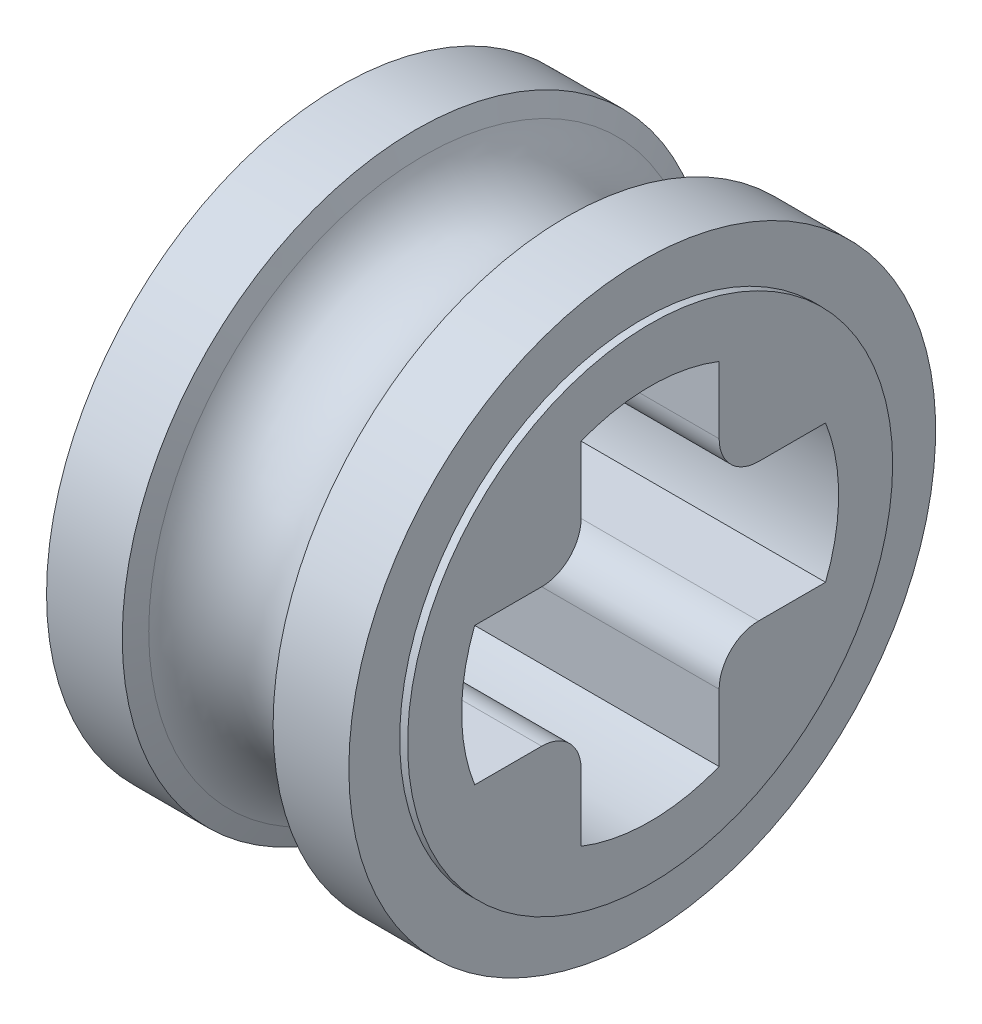
ISO-10303-21;
HEADER;
FILE_DESCRIPTION(('STEP AP214'),'2;1');
FILE_NAME('part.step','',(''),(''),'','','');
FILE_SCHEMA(('AUTOMOTIVE_DESIGN { 1 0 10303 214 1 1 1 1 }'));
ENDSEC;
DATA;
#1=APPLICATION_CONTEXT('core data for automotive mechanical design processes');
#2=APPLICATION_PROTOCOL_DEFINITION('international standard','automotive_design',2000,#1);
#3=PRODUCT_CONTEXT('',#1,'mechanical');
#4=PRODUCT('Part','Part','',(#3));
#5=PRODUCT_RELATED_PRODUCT_CATEGORY('part','',(#4));
#6=PRODUCT_DEFINITION_FORMATION('','',#4);
#7=PRODUCT_DEFINITION_CONTEXT('part definition',#1,'design');
#8=PRODUCT_DEFINITION('design','',#6,#7);
#9=PRODUCT_DEFINITION_SHAPE('','',#8);
#10=(LENGTH_UNIT() NAMED_UNIT(*) SI_UNIT(.MILLI.,.METRE.));
#11=(NAMED_UNIT(*) PLANE_ANGLE_UNIT() SI_UNIT($,.RADIAN.));
#12=(NAMED_UNIT(*) SI_UNIT($,.STERADIAN.) SOLID_ANGLE_UNIT());
#13=UNCERTAINTY_MEASURE_WITH_UNIT(LENGTH_MEASURE(1.E-05),#10,'distance_accuracy_value','');
#14=(GEOMETRIC_REPRESENTATION_CONTEXT(3) GLOBAL_UNCERTAINTY_ASSIGNED_CONTEXT((#13)) GLOBAL_UNIT_ASSIGNED_CONTEXT((#10,
#11,#12)) REPRESENTATION_CONTEXT('',''));
#15=CARTESIAN_POINT('',(0.,0.,0.));
#16=DIRECTION('',(0.,0.,1.));
#17=DIRECTION('',(1.,0.,0.));
#18=AXIS2_PLACEMENT_3D('',#15,#16,#17);
#19=CARTESIAN_POINT('',(2.03131848710658,1.37499999999999,1.37499999999999));
#20=DIRECTION('',(-1.,0.,0.));
#21=DIRECTION('',(0.,0.,1.));
#22=AXIS2_PLACEMENT_3D('',#19,#20,#21);
#23=CYLINDRICAL_SURFACE('',#22,0.5);
#24=DIRECTION('',(1.,0.,0.));
#25=VECTOR('',#24,1.);
#26=CARTESIAN_POINT('',(4.0325,0.874999999999994,1.37499999999999));
#27=LINE('',#26,#25);
#28=CARTESIAN_POINT('',(2.01625,0.874999999999994,1.37499999999999));
#29=VERTEX_POINT('',#28);
#30=CARTESIAN_POINT('',(-2.01625,0.874999999999994,1.37499999999999));
#31=VERTEX_POINT('',#30);
#32=EDGE_CURVE('E157',#29,#31,#27,.F.);
#33=ORIENTED_EDGE('',*,*,#32,.T.);
#34=CARTESIAN_POINT('',(-2.01625,1.37499999999999,1.37499999999999));
#35=DIRECTION('',(-1.,0.,0.));
#36=DIRECTION('',(0.,0.,1.));
#37=AXIS2_PLACEMENT_3D('',#34,#35,#36);
#38=CIRCLE('',#37,0.5);
#39=CARTESIAN_POINT('',(-2.01625,1.37499999999999,0.874999999999995));
#40=VERTEX_POINT('',#39);
#41=EDGE_CURVE('E139',#31,#40,#38,.F.);
#42=ORIENTED_EDGE('',*,*,#41,.T.);
#43=DIRECTION('',(1.,0.,0.));
#44=VECTOR('',#43,1.);
#45=CARTESIAN_POINT('',(4.0325,1.37499999999999,0.874999999999995));
#46=LINE('',#45,#44);
#47=CARTESIAN_POINT('',(2.01625,1.37499999999999,0.874999999999995));
#48=VERTEX_POINT('',#47);
#49=EDGE_CURVE('E143',#40,#48,#46,.T.);
#50=ORIENTED_EDGE('',*,*,#49,.T.);
#51=CARTESIAN_POINT('',(2.01625,1.37499999999999,1.37499999999999));
#52=DIRECTION('',(-1.,0.,0.));
#53=DIRECTION('',(0.,0.,1.));
#54=AXIS2_PLACEMENT_3D('',#51,#52,#53);
#55=CIRCLE('',#54,0.5);
#56=EDGE_CURVE('E19',#48,#29,#55,.T.);
#57=ORIENTED_EDGE('',*,*,#56,.T.);
#58=EDGE_LOOP('',(#33,#42,#50,#57));
#59=FACE_BOUND('',#58,.T.);
#60=ADVANCED_FACE('F16',(#59),#23,.T.);
#61=CARTESIAN_POINT('',(2.03131848710658,1.37499999999999,-1.37499999999999));
#62=DIRECTION('',(-1.,0.,0.));
#63=DIRECTION('',(0.,0.,1.));
#64=AXIS2_PLACEMENT_3D('',#61,#62,#63);
#65=CYLINDRICAL_SURFACE('',#64,0.5);
#66=DIRECTION('',(1.,0.,0.));
#67=VECTOR('',#66,1.);
#68=CARTESIAN_POINT('',(4.0325,1.37499999999999,-0.874999999999995));
#69=LINE('',#68,#67);
#70=CARTESIAN_POINT('',(2.01625,1.37499999999999,-0.874999999999995));
#71=VERTEX_POINT('',#70);
#72=CARTESIAN_POINT('',(-2.01625,1.37499999999999,-0.874999999999995));
#73=VERTEX_POINT('',#72);
#74=EDGE_CURVE('E155',#71,#73,#69,.F.);
#75=ORIENTED_EDGE('',*,*,#74,.T.);
#76=CARTESIAN_POINT('',(-2.01625,1.37499999999999,-1.37499999999999));
#77=DIRECTION('',(-1.,0.,0.));
#78=DIRECTION('',(0.,0.,1.));
#79=AXIS2_PLACEMENT_3D('',#76,#77,#78);
#80=CIRCLE('',#79,0.5);
#81=CARTESIAN_POINT('',(-2.01625,0.874999999999994,-1.37499999999999));
#82=VERTEX_POINT('',#81);
#83=EDGE_CURVE('E214',#73,#82,#80,.F.);
#84=ORIENTED_EDGE('',*,*,#83,.T.);
#85=DIRECTION('',(1.,0.,0.));
#86=VECTOR('',#85,1.);
#87=CARTESIAN_POINT('',(4.0325,0.874999999999994,-1.37499999999999));
#88=LINE('',#87,#86);
#89=CARTESIAN_POINT('',(2.01625,0.874999999999994,-1.37499999999999));
#90=VERTEX_POINT('',#89);
#91=EDGE_CURVE('E223',#82,#90,#88,.T.);
#92=ORIENTED_EDGE('',*,*,#91,.T.);
#93=CARTESIAN_POINT('',(2.01625,1.37499999999999,-1.37499999999999));
#94=DIRECTION('',(-1.,0.,0.));
#95=DIRECTION('',(0.,0.,1.));
#96=AXIS2_PLACEMENT_3D('',#93,#94,#95);
#97=CIRCLE('',#96,0.5);
#98=EDGE_CURVE('E216',#90,#71,#97,.T.);
#99=ORIENTED_EDGE('',*,*,#98,.T.);
#100=EDGE_LOOP('',(#75,#84,#92,#99));
#101=FACE_BOUND('',#100,.T.);
#102=ADVANCED_FACE('F221',(#101),#65,.T.);
#103=CARTESIAN_POINT('',(2.03131848710658,-1.37499999999999,-1.37499999999999));
#104=DIRECTION('',(-1.,0.,0.));
#105=DIRECTION('',(0.,0.,1.));
#106=AXIS2_PLACEMENT_3D('',#103,#104,#105);
#107=CYLINDRICAL_SURFACE('',#106,0.5);
#108=DIRECTION('',(1.,0.,0.));
#109=VECTOR('',#108,1.);
#110=CARTESIAN_POINT('',(4.0325,-0.874999999999994,-1.37499999999999));
#111=LINE('',#110,#109);
#112=CARTESIAN_POINT('',(2.01625,-0.874999999999994,-1.37499999999999));
#113=VERTEX_POINT('',#112);
#114=CARTESIAN_POINT('',(-2.01625,-0.874999999999994,-1.37499999999999));
#115=VERTEX_POINT('',#114);
#116=EDGE_CURVE('E253',#113,#115,#111,.F.);
#117=ORIENTED_EDGE('',*,*,#116,.T.);
#118=CARTESIAN_POINT('',(-2.01625,-1.37499999999999,-1.37499999999999));
#119=DIRECTION('',(-1.,0.,0.));
#120=DIRECTION('',(0.,0.,1.));
#121=AXIS2_PLACEMENT_3D('',#118,#119,#120);
#122=CIRCLE('',#121,0.5);
#123=CARTESIAN_POINT('',(-2.01625,-1.37499999999999,-0.874999999999995));
#124=VERTEX_POINT('',#123);
#125=EDGE_CURVE('E210',#115,#124,#122,.F.);
#126=ORIENTED_EDGE('',*,*,#125,.T.);
#127=DIRECTION('',(1.,0.,0.));
#128=VECTOR('',#127,1.);
#129=CARTESIAN_POINT('',(4.0325,-1.37499999999999,-0.874999999999995));
#130=LINE('',#129,#128);
#131=CARTESIAN_POINT('',(2.01625,-1.37499999999999,-0.874999999999995));
#132=VERTEX_POINT('',#131);
#133=EDGE_CURVE('E248',#124,#132,#130,.T.);
#134=ORIENTED_EDGE('',*,*,#133,.T.);
#135=CARTESIAN_POINT('',(2.01625,-1.37499999999999,-1.37499999999999));
#136=DIRECTION('',(-1.,0.,0.));
#137=DIRECTION('',(0.,0.,1.));
#138=AXIS2_PLACEMENT_3D('',#135,#136,#137);
#139=CIRCLE('',#138,0.5);
#140=EDGE_CURVE('E212',#132,#113,#139,.T.);
#141=ORIENTED_EDGE('',*,*,#140,.T.);
#142=EDGE_LOOP('',(#117,#126,#134,#141));
#143=FACE_BOUND('',#142,.T.);
#144=ADVANCED_FACE('F387',(#143),#107,.T.);
#145=CARTESIAN_POINT('',(2.03131848710658,-1.37499999999999,1.37499999999999));
#146=DIRECTION('',(-1.,0.,0.));
#147=DIRECTION('',(0.,0.,1.));
#148=AXIS2_PLACEMENT_3D('',#145,#146,#147);
#149=CYLINDRICAL_SURFACE('',#148,0.5);
#150=DIRECTION('',(1.,0.,0.));
#151=VECTOR('',#150,1.);
#152=CARTESIAN_POINT('',(4.0325,-1.37499999999999,0.874999999999995));
#153=LINE('',#152,#151);
#154=CARTESIAN_POINT('',(2.01625,-1.37499999999999,0.874999999999995));
#155=VERTEX_POINT('',#154);
#156=CARTESIAN_POINT('',(-2.01625,-1.37499999999999,0.874999999999995));
#157=VERTEX_POINT('',#156);
#158=EDGE_CURVE('E244',#155,#157,#153,.F.);
#159=ORIENTED_EDGE('',*,*,#158,.T.);
#160=CARTESIAN_POINT('',(-2.01625,-1.37499999999999,1.37499999999999));
#161=DIRECTION('',(-1.,0.,0.));
#162=DIRECTION('',(0.,0.,1.));
#163=AXIS2_PLACEMENT_3D('',#160,#161,#162);
#164=CIRCLE('',#163,0.5);
#165=CARTESIAN_POINT('',(-2.01625,-0.874999999999994,1.37499999999999));
#166=VERTEX_POINT('',#165);
#167=EDGE_CURVE('E164',#157,#166,#164,.F.);
#168=ORIENTED_EDGE('',*,*,#167,.T.);
#169=DIRECTION('',(1.,0.,0.));
#170=VECTOR('',#169,1.);
#171=CARTESIAN_POINT('',(4.0325,-0.874999999999994,1.37499999999999));
#172=LINE('',#171,#170);
#173=CARTESIAN_POINT('',(2.01625,-0.874999999999994,1.37499999999999));
#174=VERTEX_POINT('',#173);
#175=EDGE_CURVE('E160',#166,#174,#172,.T.);
#176=ORIENTED_EDGE('',*,*,#175,.T.);
#177=CARTESIAN_POINT('',(2.01625,-1.37499999999999,1.37499999999999));
#178=DIRECTION('',(-1.,0.,0.));
#179=DIRECTION('',(0.,0.,1.));
#180=AXIS2_PLACEMENT_3D('',#177,#178,#179);
#181=CIRCLE('',#180,0.5);
#182=EDGE_CURVE('E208',#174,#155,#181,.T.);
#183=ORIENTED_EDGE('',*,*,#182,.T.);
#184=EDGE_LOOP('',(#159,#168,#176,#183));
#185=FACE_BOUND('',#184,.T.);
#186=ADVANCED_FACE('F383',(#185),#149,.T.);
#187=CARTESIAN_POINT('',(4.0325,-0.874999999999994,0.874999999999995));
#188=DIRECTION('',(0.,-1.,0.));
#189=DIRECTION('',(0.,0.,-1.));
#190=AXIS2_PLACEMENT_3D('',#187,#188,#189);
#191=PLANE('',#190);
#192=DIRECTION('',(-1.,0.,0.));
#193=VECTOR('',#192,1.);
#194=CARTESIAN_POINT('',(4.0325,-0.874999999999995,2.22406722020716));
#195=LINE('',#194,#193);
#196=CARTESIAN_POINT('',(-2.01625,-0.874999999999995,2.22406722020716));
#197=VERTEX_POINT('',#196);
#198=CARTESIAN_POINT('',(2.01625,-0.874999999999995,2.22406722020716));
#199=VERTEX_POINT('',#198);
#200=EDGE_CURVE('E271',#197,#199,#195,.F.);
#201=ORIENTED_EDGE('',*,*,#200,.T.);
#202=DIRECTION('',(0.,0.,-1.));
#203=VECTOR('',#202,1.);
#204=CARTESIAN_POINT('',(2.01625,-0.874999999999994,0.874999999999995));
#205=LINE('',#204,#203);
#206=EDGE_CURVE('E163',#174,#199,#205,.F.);
#207=ORIENTED_EDGE('',*,*,#206,.F.);
#208=ORIENTED_EDGE('',*,*,#175,.F.);
#209=DIRECTION('',(0.,0.,-1.));
#210=VECTOR('',#209,1.);
#211=CARTESIAN_POINT('',(-2.01625,-0.874999999999994,0.874999999999995));
#212=LINE('',#211,#210);
#213=EDGE_CURVE('E159',#197,#166,#212,.T.);
#214=ORIENTED_EDGE('',*,*,#213,.F.);
#215=EDGE_LOOP('',(#201,#207,#208,#214));
#216=FACE_BOUND('',#215,.T.);
#217=ADVANCED_FACE('F379',(#216),#191,.F.);
#218=CARTESIAN_POINT('',(4.0325,0.874999999999995,2.22406722020716));
#219=DIRECTION('',(0.,1.,0.));
#220=DIRECTION('',(0.,0.,1.));
#221=AXIS2_PLACEMENT_3D('',#218,#219,#220);
#222=PLANE('',#221);
#223=DIRECTION('',(-1.,0.,0.));
#224=VECTOR('',#223,1.);
#225=CARTESIAN_POINT('',(4.0325,0.874999999999995,2.22406722020716));
#226=LINE('',#225,#224);
#227=CARTESIAN_POINT('',(2.01625,0.874999999999995,2.22406722020716));
#228=VERTEX_POINT('',#227);
#229=CARTESIAN_POINT('',(-2.01625,0.874999999999995,2.22406722020716));
#230=VERTEX_POINT('',#229);
#231=EDGE_CURVE('E274',#228,#230,#226,.T.);
#232=ORIENTED_EDGE('',*,*,#231,.T.);
#233=DIRECTION('',(0.,0.,1.));
#234=VECTOR('',#233,1.);
#235=CARTESIAN_POINT('',(-2.01625,0.874999999999995,2.22406722020716));
#236=LINE('',#235,#234);
#237=EDGE_CURVE('E151',#31,#230,#236,.T.);
#238=ORIENTED_EDGE('',*,*,#237,.F.);
#239=ORIENTED_EDGE('',*,*,#32,.F.);
#240=DIRECTION('',(0.,0.,1.));
#241=VECTOR('',#240,1.);
#242=CARTESIAN_POINT('',(2.01625,0.874999999999995,2.22406722020716));
#243=LINE('',#242,#241);
#244=EDGE_CURVE('E134',#228,#29,#243,.F.);
#245=ORIENTED_EDGE('',*,*,#244,.F.);
#246=EDGE_LOOP('',(#232,#238,#239,#245));
#247=FACE_BOUND('',#246,.T.);
#248=ADVANCED_FACE('F376',(#247),#222,.F.);
#249=CARTESIAN_POINT('',(4.0325,0.874999999999994,0.874999999999995));
#250=DIRECTION('',(0.,0.,1.));
#251=DIRECTION('',(1.,0.,0.));
#252=AXIS2_PLACEMENT_3D('',#249,#250,#251);
#253=PLANE('',#252);
#254=DIRECTION('',(-1.,0.,0.));
#255=VECTOR('',#254,1.);
#256=CARTESIAN_POINT('',(4.0325,2.22406722020716,0.874999999999995));
#257=LINE('',#256,#255);
#258=CARTESIAN_POINT('',(-2.01625,2.22406722020716,0.874999999999995));
#259=VERTEX_POINT('',#258);
#260=CARTESIAN_POINT('',(2.01625,2.22406722020716,0.874999999999995));
#261=VERTEX_POINT('',#260);
#262=EDGE_CURVE('E146',#259,#261,#257,.F.);
#263=ORIENTED_EDGE('',*,*,#262,.T.);
#264=DIRECTION('',(0.,1.,0.));
#265=VECTOR('',#264,1.);
#266=CARTESIAN_POINT('',(2.01625,0.874999999999994,0.874999999999995));
#267=LINE('',#266,#265);
#268=EDGE_CURVE('E131',#48,#261,#267,.T.);
#269=ORIENTED_EDGE('',*,*,#268,.F.);
#270=ORIENTED_EDGE('',*,*,#49,.F.);
#271=DIRECTION('',(0.,1.,0.));
#272=VECTOR('',#271,1.);
#273=CARTESIAN_POINT('',(-2.01625,0.874999999999994,0.874999999999995));
#274=LINE('',#273,#272);
#275=EDGE_CURVE('E148',#259,#40,#274,.F.);
#276=ORIENTED_EDGE('',*,*,#275,.F.);
#277=EDGE_LOOP('',(#263,#269,#270,#276));
#278=FACE_BOUND('',#277,.T.);
#279=ADVANCED_FACE('F142',(#278),#253,.F.);
#280=CARTESIAN_POINT('',(4.0325,2.22406722020716,-0.874999999999995));
#281=DIRECTION('',(0.,0.,-1.));
#282=DIRECTION('',(0.,1.,0.));
#283=AXIS2_PLACEMENT_3D('',#280,#281,#282);
#284=PLANE('',#283);
#285=DIRECTION('',(-1.,0.,0.));
#286=VECTOR('',#285,1.);
#287=CARTESIAN_POINT('',(4.0325,2.22406722020716,-0.874999999999994));
#288=LINE('',#287,#286);
#289=CARTESIAN_POINT('',(2.01625,2.22406722020716,-0.874999999999995));
#290=VERTEX_POINT('',#289);
#291=CARTESIAN_POINT('',(-2.01625,2.22406722020716,-0.874999999999995));
#292=VERTEX_POINT('',#291);
#293=EDGE_CURVE('E278',#290,#292,#288,.T.);
#294=ORIENTED_EDGE('',*,*,#293,.T.);
#295=DIRECTION('',(0.,1.,0.));
#296=VECTOR('',#295,1.);
#297=CARTESIAN_POINT('',(-2.01625,2.22406722020716,-0.874999999999995));
#298=LINE('',#297,#296);
#299=EDGE_CURVE('E232',#73,#292,#298,.T.);
#300=ORIENTED_EDGE('',*,*,#299,.F.);
#301=ORIENTED_EDGE('',*,*,#74,.F.);
#302=DIRECTION('',(0.,1.,0.));
#303=VECTOR('',#302,1.);
#304=CARTESIAN_POINT('',(2.01625,2.22406722020716,-0.874999999999995));
#305=LINE('',#304,#303);
#306=EDGE_CURVE('E230',#290,#71,#305,.F.);
#307=ORIENTED_EDGE('',*,*,#306,.F.);
#308=EDGE_LOOP('',(#294,#300,#301,#307));
#309=FACE_BOUND('',#308,.T.);
#310=ADVANCED_FACE('F229',(#309),#284,.F.);
#311=CARTESIAN_POINT('',(4.0325,0.874999999999994,-0.874999999999995));
#312=DIRECTION('',(0.,1.,0.));
#313=DIRECTION('',(0.,0.,1.));
#314=AXIS2_PLACEMENT_3D('',#311,#312,#313);
#315=PLANE('',#314);
#316=DIRECTION('',(-1.,0.,0.));
#317=VECTOR('',#316,1.);
#318=CARTESIAN_POINT('',(4.0325,0.874999999999995,-2.22406722020716));
#319=LINE('',#318,#317);
#320=CARTESIAN_POINT('',(-2.01625,0.874999999999995,-2.22406722020716));
#321=VERTEX_POINT('',#320);
#322=CARTESIAN_POINT('',(2.01625,0.874999999999995,-2.22406722020716));
#323=VERTEX_POINT('',#322);
#324=EDGE_CURVE('E280',#321,#323,#319,.F.);
#325=ORIENTED_EDGE('',*,*,#324,.T.);
#326=DIRECTION('',(0.,0.,1.));
#327=VECTOR('',#326,1.);
#328=CARTESIAN_POINT('',(2.01625,0.874999999999994,-0.874999999999995));
#329=LINE('',#328,#327);
#330=EDGE_CURVE('E234',#90,#323,#329,.F.);
#331=ORIENTED_EDGE('',*,*,#330,.F.);
#332=ORIENTED_EDGE('',*,*,#91,.F.);
#333=DIRECTION('',(0.,0.,1.));
#334=VECTOR('',#333,1.);
#335=CARTESIAN_POINT('',(-2.01625,0.874999999999994,-0.874999999999995));
#336=LINE('',#335,#334);
#337=EDGE_CURVE('E256',#321,#82,#336,.T.);
#338=ORIENTED_EDGE('',*,*,#337,.F.);
#339=EDGE_LOOP('',(#325,#331,#332,#338));
#340=FACE_BOUND('',#339,.T.);
#341=ADVANCED_FACE('F367',(#340),#315,.F.);
#342=CARTESIAN_POINT('',(4.0325,-0.874999999999994,-2.22406722020716));
#343=DIRECTION('',(0.,-1.,0.));
#344=DIRECTION('',(0.,0.,-1.));
#345=AXIS2_PLACEMENT_3D('',#342,#343,#344);
#346=PLANE('',#345);
#347=DIRECTION('',(-1.,0.,0.));
#348=VECTOR('',#347,1.);
#349=CARTESIAN_POINT('',(4.0325,-0.874999999999993,-2.22406722020716));
#350=LINE('',#349,#348);
#351=CARTESIAN_POINT('',(2.01625,-0.874999999999994,-2.22406722020716));
#352=VERTEX_POINT('',#351);
#353=CARTESIAN_POINT('',(-2.01625,-0.874999999999994,-2.22406722020716));
#354=VERTEX_POINT('',#353);
#355=EDGE_CURVE('E283',#352,#354,#350,.T.);
#356=ORIENTED_EDGE('',*,*,#355,.T.);
#357=DIRECTION('',(0.,0.,-1.));
#358=VECTOR('',#357,1.);
#359=CARTESIAN_POINT('',(-2.01625,-0.874999999999994,-2.22406722020716));
#360=LINE('',#359,#358);
#361=EDGE_CURVE('E255',#115,#354,#360,.T.);
#362=ORIENTED_EDGE('',*,*,#361,.F.);
#363=ORIENTED_EDGE('',*,*,#116,.F.);
#364=DIRECTION('',(0.,0.,-1.));
#365=VECTOR('',#364,1.);
#366=CARTESIAN_POINT('',(2.01625,-0.874999999999994,-2.22406722020716));
#367=LINE('',#366,#365);
#368=EDGE_CURVE('E252',#352,#113,#367,.F.);
#369=ORIENTED_EDGE('',*,*,#368,.F.);
#370=EDGE_LOOP('',(#356,#362,#363,#369));
#371=FACE_BOUND('',#370,.T.);
#372=ADVANCED_FACE('F363',(#371),#346,.F.);
#373=CARTESIAN_POINT('',(4.0325,-0.874999999999994,-0.874999999999995));
#374=DIRECTION('',(0.,0.,-1.));
#375=DIRECTION('',(0.,1.,0.));
#376=AXIS2_PLACEMENT_3D('',#373,#374,#375);
#377=PLANE('',#376);
#378=DIRECTION('',(-1.,0.,0.));
#379=VECTOR('',#378,1.);
#380=CARTESIAN_POINT('',(4.0325,-2.22406722020716,-0.874999999999995));
#381=LINE('',#380,#379);
#382=CARTESIAN_POINT('',(-2.01625,-2.22406722020716,-0.874999999999995));
#383=VERTEX_POINT('',#382);
#384=CARTESIAN_POINT('',(2.01625,-2.22406722020716,-0.874999999999995));
#385=VERTEX_POINT('',#384);
#386=EDGE_CURVE('E286',#383,#385,#381,.F.);
#387=ORIENTED_EDGE('',*,*,#386,.T.);
#388=DIRECTION('',(0.,1.,0.));
#389=VECTOR('',#388,1.);
#390=CARTESIAN_POINT('',(2.01625,-0.874999999999994,-0.874999999999995));
#391=LINE('',#390,#389);
#392=EDGE_CURVE('E251',#132,#385,#391,.F.);
#393=ORIENTED_EDGE('',*,*,#392,.F.);
#394=ORIENTED_EDGE('',*,*,#133,.F.);
#395=DIRECTION('',(0.,1.,0.));
#396=VECTOR('',#395,1.);
#397=CARTESIAN_POINT('',(-2.01625,-0.874999999999994,-0.874999999999995));
#398=LINE('',#397,#396);
#399=EDGE_CURVE('E247',#383,#124,#398,.T.);
#400=ORIENTED_EDGE('',*,*,#399,.F.);
#401=EDGE_LOOP('',(#387,#393,#394,#400));
#402=FACE_BOUND('',#401,.T.);
#403=ADVANCED_FACE('F359',(#402),#377,.F.);
#404=CARTESIAN_POINT('',(4.0325,-2.22406722020716,0.874999999999995));
#405=DIRECTION('',(0.,0.,1.));
#406=DIRECTION('',(1.,0.,0.));
#407=AXIS2_PLACEMENT_3D('',#404,#405,#406);
#408=PLANE('',#407);
#409=DIRECTION('',(-1.,0.,0.));
#410=VECTOR('',#409,1.);
#411=CARTESIAN_POINT('',(4.0325,-2.22406722020716,0.874999999999994));
#412=LINE('',#411,#410);
#413=CARTESIAN_POINT('',(2.01625,-2.22406722020716,0.874999999999994));
#414=VERTEX_POINT('',#413);
#415=CARTESIAN_POINT('',(-2.01625,-2.22406722020716,0.874999999999994));
#416=VERTEX_POINT('',#415);
#417=EDGE_CURVE('E206',#414,#416,#412,.T.);
#418=ORIENTED_EDGE('',*,*,#417,.T.);
#419=DIRECTION('',(0.,1.,0.));
#420=VECTOR('',#419,1.);
#421=CARTESIAN_POINT('',(-2.01625,-2.22406722020716,0.874999999999995));
#422=LINE('',#421,#420);
#423=EDGE_CURVE('E34',#157,#416,#422,.F.);
#424=ORIENTED_EDGE('',*,*,#423,.F.);
#425=ORIENTED_EDGE('',*,*,#158,.F.);
#426=DIRECTION('',(0.,1.,0.));
#427=VECTOR('',#426,1.);
#428=CARTESIAN_POINT('',(2.01625,-2.22406722020716,0.874999999999995));
#429=LINE('',#428,#427);
#430=EDGE_CURVE('E269',#414,#155,#429,.T.);
#431=ORIENTED_EDGE('',*,*,#430,.F.);
#432=EDGE_LOOP('',(#418,#424,#425,#431));
#433=FACE_BOUND('',#432,.T.);
#434=ADVANCED_FACE('F355',(#433),#408,.F.);
#435=CARTESIAN_POINT('',(4.0325,0.,0.));
#436=DIRECTION('',(-1.,0.,0.));
#437=DIRECTION('',(0.,0.,1.));
#438=AXIS2_PLACEMENT_3D('',#435,#436,#437);
#439=CYLINDRICAL_SURFACE('',#438,2.39);
#440=ORIENTED_EDGE('',*,*,#231,.F.);
#441=CARTESIAN_POINT('',(2.01625,0.,0.));
#442=DIRECTION('',(-1.,0.,0.));
#443=DIRECTION('',(0.,0.,1.));
#444=AXIS2_PLACEMENT_3D('',#441,#442,#443);
#445=CIRCLE('',#444,2.39);
#446=EDGE_CURVE('E204',#199,#228,#445,.T.);
#447=ORIENTED_EDGE('',*,*,#446,.F.);
#448=ORIENTED_EDGE('',*,*,#200,.F.);
#449=CARTESIAN_POINT('',(-2.01625,0.,0.));
#450=DIRECTION('',(-1.,0.,0.));
#451=DIRECTION('',(0.,0.,1.));
#452=AXIS2_PLACEMENT_3D('',#449,#450,#451);
#453=CIRCLE('',#452,2.39);
#454=EDGE_CURVE('E193',#197,#230,#453,.T.);
#455=ORIENTED_EDGE('',*,*,#454,.T.);
#456=EDGE_LOOP('',(#440,#447,#448,#455));
#457=FACE_BOUND('',#456,.T.);
#458=ADVANCED_FACE('F351',(#457),#439,.F.);
#459=CARTESIAN_POINT('',(4.0325,0.,0.));
#460=DIRECTION('',(-1.,0.,0.));
#461=DIRECTION('',(0.,0.,1.));
#462=AXIS2_PLACEMENT_3D('',#459,#460,#461);
#463=CYLINDRICAL_SURFACE('',#462,2.39);
#464=ORIENTED_EDGE('',*,*,#293,.F.);
#465=CARTESIAN_POINT('',(2.01625,0.,0.));
#466=DIRECTION('',(-1.,0.,0.));
#467=DIRECTION('',(0.,0.,1.));
#468=AXIS2_PLACEMENT_3D('',#465,#466,#467);
#469=CIRCLE('',#468,2.39);
#470=EDGE_CURVE('E202',#261,#290,#469,.T.);
#471=ORIENTED_EDGE('',*,*,#470,.F.);
#472=ORIENTED_EDGE('',*,*,#262,.F.);
#473=CARTESIAN_POINT('',(-2.01625,0.,0.));
#474=DIRECTION('',(-1.,0.,0.));
#475=DIRECTION('',(0.,0.,1.));
#476=AXIS2_PLACEMENT_3D('',#473,#474,#475);
#477=CIRCLE('',#476,2.39);
#478=EDGE_CURVE('E190',#259,#292,#477,.T.);
#479=ORIENTED_EDGE('',*,*,#478,.T.);
#480=EDGE_LOOP('',(#464,#471,#472,#479));
#481=FACE_BOUND('',#480,.T.);
#482=ADVANCED_FACE('F347',(#481),#463,.F.);
#483=CARTESIAN_POINT('',(4.0325,0.,0.));
#484=DIRECTION('',(-1.,0.,0.));
#485=DIRECTION('',(0.,0.,1.));
#486=AXIS2_PLACEMENT_3D('',#483,#484,#485);
#487=CYLINDRICAL_SURFACE('',#486,2.39);
#488=ORIENTED_EDGE('',*,*,#355,.F.);
#489=CARTESIAN_POINT('',(2.01625,0.,0.));
#490=DIRECTION('',(-1.,0.,0.));
#491=DIRECTION('',(0.,0.,1.));
#492=AXIS2_PLACEMENT_3D('',#489,#490,#491);
#493=CIRCLE('',#492,2.39);
#494=EDGE_CURVE('E199',#323,#352,#493,.T.);
#495=ORIENTED_EDGE('',*,*,#494,.F.);
#496=ORIENTED_EDGE('',*,*,#324,.F.);
#497=CARTESIAN_POINT('',(-2.01625,0.,0.));
#498=DIRECTION('',(-1.,0.,0.));
#499=DIRECTION('',(0.,0.,1.));
#500=AXIS2_PLACEMENT_3D('',#497,#498,#499);
#501=CIRCLE('',#500,2.39);
#502=EDGE_CURVE('E187',#321,#354,#501,.T.);
#503=ORIENTED_EDGE('',*,*,#502,.T.);
#504=EDGE_LOOP('',(#488,#495,#496,#503));
#505=FACE_BOUND('',#504,.T.);
#506=ADVANCED_FACE('F343',(#505),#487,.F.);
#507=CARTESIAN_POINT('',(4.0325,0.,0.));
#508=DIRECTION('',(-1.,0.,0.));
#509=DIRECTION('',(0.,0.,1.));
#510=AXIS2_PLACEMENT_3D('',#507,#508,#509);
#511=CYLINDRICAL_SURFACE('',#510,2.39);
#512=ORIENTED_EDGE('',*,*,#417,.F.);
#513=CARTESIAN_POINT('',(2.01625,0.,0.));
#514=DIRECTION('',(-1.,0.,0.));
#515=DIRECTION('',(0.,0.,1.));
#516=AXIS2_PLACEMENT_3D('',#513,#514,#515);
#517=CIRCLE('',#516,2.39);
#518=EDGE_CURVE('E196',#385,#414,#517,.T.);
#519=ORIENTED_EDGE('',*,*,#518,.F.);
#520=ORIENTED_EDGE('',*,*,#386,.F.);
#521=CARTESIAN_POINT('',(-2.01625,0.,0.));
#522=DIRECTION('',(-1.,0.,0.));
#523=DIRECTION('',(0.,0.,1.));
#524=AXIS2_PLACEMENT_3D('',#521,#522,#523);
#525=CIRCLE('',#524,2.39);
#526=EDGE_CURVE('E184',#383,#416,#525,.T.);
#527=ORIENTED_EDGE('',*,*,#526,.T.);
#528=EDGE_LOOP('',(#512,#519,#520,#527));
#529=FACE_BOUND('',#528,.T.);
#530=ADVANCED_FACE('F340',(#529),#511,.F.);
#531=CARTESIAN_POINT('',(2.01625,0.,0.));
#532=DIRECTION('',(1.,0.,0.));
#533=DIRECTION('',(0.,0.,-1.));
#534=AXIS2_PLACEMENT_3D('',#531,#532,#533);
#535=PLANE('',#534);
#536=ORIENTED_EDGE('',*,*,#430,.T.);
#537=ORIENTED_EDGE('',*,*,#182,.F.);
#538=ORIENTED_EDGE('',*,*,#206,.T.);
#539=ORIENTED_EDGE('',*,*,#446,.T.);
#540=ORIENTED_EDGE('',*,*,#244,.T.);
#541=ORIENTED_EDGE('',*,*,#56,.F.);
#542=ORIENTED_EDGE('',*,*,#268,.T.);
#543=ORIENTED_EDGE('',*,*,#470,.T.);
#544=ORIENTED_EDGE('',*,*,#306,.T.);
#545=ORIENTED_EDGE('',*,*,#98,.F.);
#546=ORIENTED_EDGE('',*,*,#330,.T.);
#547=ORIENTED_EDGE('',*,*,#494,.T.);
#548=ORIENTED_EDGE('',*,*,#368,.T.);
#549=ORIENTED_EDGE('',*,*,#140,.F.);
#550=ORIENTED_EDGE('',*,*,#392,.T.);
#551=ORIENTED_EDGE('',*,*,#518,.T.);
#552=EDGE_LOOP('',(#536,#537,#538,#539,#540,#541,#542,#543,#544,#545,#546,#547,#548,#549,#550,#551));
#553=FACE_BOUND('',#552,.T.);
#554=CARTESIAN_POINT('',(2.01625,0.,0.));
#555=DIRECTION('',(1.,0.,0.));
#556=DIRECTION('',(0.,0.,-1.));
#557=AXIS2_PLACEMENT_3D('',#554,#555,#556);
#558=CIRCLE('',#557,3.075);
#559=CARTESIAN_POINT('',(2.01625,0.,-3.075));
#560=VERTEX_POINT('',#559);
#561=EDGE_CURVE('E181',#560,#560,#558,.F.);
#562=ORIENTED_EDGE('',*,*,#561,.F.);
#563=EDGE_LOOP('',(#562));
#564=FACE_BOUND('',#563,.T.);
#565=ADVANCED_FACE('F128',(#553,#564),#535,.T.);
#566=CARTESIAN_POINT('',(-2.01625,0.,0.));
#567=DIRECTION('',(1.,0.,0.));
#568=DIRECTION('',(0.,0.,-1.));
#569=AXIS2_PLACEMENT_3D('',#566,#567,#568);
#570=PLANE('',#569);
#571=ORIENTED_EDGE('',*,*,#526,.F.);
#572=ORIENTED_EDGE('',*,*,#399,.T.);
#573=ORIENTED_EDGE('',*,*,#125,.F.);
#574=ORIENTED_EDGE('',*,*,#361,.T.);
#575=ORIENTED_EDGE('',*,*,#502,.F.);
#576=ORIENTED_EDGE('',*,*,#337,.T.);
#577=ORIENTED_EDGE('',*,*,#83,.F.);
#578=ORIENTED_EDGE('',*,*,#299,.T.);
#579=ORIENTED_EDGE('',*,*,#478,.F.);
#580=ORIENTED_EDGE('',*,*,#275,.T.);
#581=ORIENTED_EDGE('',*,*,#41,.F.);
#582=ORIENTED_EDGE('',*,*,#237,.T.);
#583=ORIENTED_EDGE('',*,*,#454,.F.);
#584=ORIENTED_EDGE('',*,*,#213,.T.);
#585=ORIENTED_EDGE('',*,*,#167,.F.);
#586=ORIENTED_EDGE('',*,*,#423,.T.);
#587=EDGE_LOOP('',(#571,#572,#573,#574,#575,#576,#577,#578,#579,#580,#581,#582,#583,#584,#585,#586));
#588=FACE_BOUND('',#587,.T.);
#589=CARTESIAN_POINT('',(-2.01625,0.,0.));
#590=DIRECTION('',(1.,0.,0.));
#591=DIRECTION('',(0.,0.,-1.));
#592=AXIS2_PLACEMENT_3D('',#589,#590,#591);
#593=CIRCLE('',#592,3.075);
#594=CARTESIAN_POINT('',(-2.01625,0.,-3.075));
#595=VERTEX_POINT('',#594);
#596=EDGE_CURVE('E178',#595,#595,#593,.T.);
#597=ORIENTED_EDGE('',*,*,#596,.F.);
#598=EDGE_LOOP('',(#597));
#599=FACE_BOUND('',#598,.T.);
#600=ADVANCED_FACE('F334',(#588,#599),#570,.F.);
#601=CARTESIAN_POINT('',(1.91625,0.,0.));
#602=DIRECTION('',(1.,0.,0.));
#603=DIRECTION('',(0.,0.,-1.));
#604=AXIS2_PLACEMENT_3D('',#601,#602,#603);
#605=CYLINDRICAL_SURFACE('',#604,3.075);
#606=ORIENTED_EDGE('',*,*,#561,.T.);
#607=EDGE_LOOP('',(#606));
#608=FACE_BOUND('',#607,.T.);
#609=CARTESIAN_POINT('',(1.91625,0.,0.));
#610=DIRECTION('',(1.,0.,0.));
#611=DIRECTION('',(0.,0.,-1.));
#612=AXIS2_PLACEMENT_3D('',#609,#610,#611);
#613=CIRCLE('',#612,3.075);
#614=CARTESIAN_POINT('',(1.91625,0.,-3.075));
#615=VERTEX_POINT('',#614);
#616=EDGE_CURVE('E175',#615,#615,#613,.T.);
#617=ORIENTED_EDGE('',*,*,#616,.T.);
#618=EDGE_LOOP('',(#617));
#619=FACE_BOUND('',#618,.T.);
#620=ADVANCED_FACE('F330',(#608,#619),#605,.T.);
#621=CARTESIAN_POINT('',(-1.91625,0.,0.));
#622=DIRECTION('',(1.,0.,0.));
#623=DIRECTION('',(0.,0.,-1.));
#624=AXIS2_PLACEMENT_3D('',#621,#622,#623);
#625=CYLINDRICAL_SURFACE('',#624,3.075);
#626=ORIENTED_EDGE('',*,*,#596,.T.);
#627=EDGE_LOOP('',(#626));
#628=FACE_BOUND('',#627,.T.);
#629=CARTESIAN_POINT('',(-1.91625,0.,0.));
#630=DIRECTION('',(1.,0.,0.));
#631=DIRECTION('',(0.,0.,-1.));
#632=AXIS2_PLACEMENT_3D('',#629,#630,#631);
#633=CIRCLE('',#632,3.075);
#634=CARTESIAN_POINT('',(-1.91625,0.,-3.075));
#635=VERTEX_POINT('',#634);
#636=EDGE_CURVE('E172',#635,#635,#633,.T.);
#637=ORIENTED_EDGE('',*,*,#636,.F.);
#638=EDGE_LOOP('',(#637));
#639=FACE_BOUND('',#638,.T.);
#640=ADVANCED_FACE('F326',(#628,#639),#625,.T.);
#641=CARTESIAN_POINT('',(1.91625,0.,0.));
#642=DIRECTION('',(-1.,0.,0.));
#643=DIRECTION('',(0.,0.,1.));
#644=AXIS2_PLACEMENT_3D('',#641,#642,#643);
#645=PLANE('',#644);
#646=ORIENTED_EDGE('',*,*,#616,.F.);
#647=EDGE_LOOP('',(#646));
#648=FACE_BOUND('',#647,.T.);
#649=CARTESIAN_POINT('',(1.91625,0.,0.));
#650=DIRECTION('',(-1.,0.,0.));
#651=DIRECTION('',(0.,0.,1.));
#652=AXIS2_PLACEMENT_3D('',#649,#650,#651);
#653=CIRCLE('',#652,3.72);
#654=CARTESIAN_POINT('',(1.91625,0.,3.72));
#655=VERTEX_POINT('',#654);
#656=EDGE_CURVE('E169',#655,#655,#653,.T.);
#657=ORIENTED_EDGE('',*,*,#656,.F.);
#658=EDGE_LOOP('',(#657));
#659=FACE_BOUND('',#658,.T.);
#660=ADVANCED_FACE('F322',(#648,#659),#645,.F.);
#661=CARTESIAN_POINT('',(-1.91625,0.,0.));
#662=DIRECTION('',(-1.,0.,0.));
#663=DIRECTION('',(0.,0.,1.));
#664=AXIS2_PLACEMENT_3D('',#661,#662,#663);
#665=PLANE('',#664);
#666=ORIENTED_EDGE('',*,*,#636,.T.);
#667=EDGE_LOOP('',(#666));
#668=FACE_BOUND('',#667,.T.);
#669=CARTESIAN_POINT('',(-1.91625,0.,0.));
#670=DIRECTION('',(-1.,0.,0.));
#671=DIRECTION('',(0.,0.,1.));
#672=AXIS2_PLACEMENT_3D('',#669,#670,#671);
#673=CIRCLE('',#672,3.72);
#674=CARTESIAN_POINT('',(-1.91625,0.,3.72));
#675=VERTEX_POINT('',#674);
#676=EDGE_CURVE('E165',#675,#675,#673,.F.);
#677=ORIENTED_EDGE('',*,*,#676,.F.);
#678=EDGE_LOOP('',(#677));
#679=FACE_BOUND('',#678,.T.);
#680=ADVANCED_FACE('F318',(#668,#679),#665,.T.);
#681=CARTESIAN_POINT('',(2.107875,0.,0.));
#682=DIRECTION('',(-1.,0.,0.));
#683=DIRECTION('',(0.,0.,1.));
#684=AXIS2_PLACEMENT_3D('',#681,#682,#683);
#685=CYLINDRICAL_SURFACE('',#684,3.72);
#686=ORIENTED_EDGE('',*,*,#656,.T.);
#687=EDGE_LOOP('',(#686));
#688=FACE_BOUND('',#687,.T.);
#689=CARTESIAN_POINT('',(0.956250000001546,0.,0.));
#690=DIRECTION('',(1.,0.,0.));
#691=DIRECTION('',(0.,0.,-1.));
#692=AXIS2_PLACEMENT_3D('',#689,#690,#691);
#693=CIRCLE('',#692,3.71999999998707);
#694=CARTESIAN_POINT('',(0.956250000001546,0.,-3.71999999998707));
#695=VERTEX_POINT('',#694);
#696=EDGE_CURVE('E168',#695,#695,#693,.F.);
#697=ORIENTED_EDGE('',*,*,#696,.F.);
#698=EDGE_LOOP('',(#697));
#699=FACE_BOUND('',#698,.T.);
#700=ADVANCED_FACE('F314',(#688,#699),#685,.T.);
#701=CARTESIAN_POINT('',(2.107875,0.,0.));
#702=DIRECTION('',(-1.,0.,0.));
#703=DIRECTION('',(0.,0.,1.));
#704=AXIS2_PLACEMENT_3D('',#701,#702,#703);
#705=CYLINDRICAL_SURFACE('',#704,3.72);
#706=ORIENTED_EDGE('',*,*,#676,.T.);
#707=EDGE_LOOP('',(#706));
#708=FACE_BOUND('',#707,.T.);
#709=CARTESIAN_POINT('',(-0.956249999973125,0.,0.));
#710=DIRECTION('',(-1.,0.,0.));
#711=DIRECTION('',(0.,0.,-1.));
#712=AXIS2_PLACEMENT_3D('',#709,#710,#711);
#713=CIRCLE('',#712,3.71999999998707);
#714=CARTESIAN_POINT('',(-0.956249999973124,0.,-3.71999999998707));
#715=VERTEX_POINT('',#714);
#716=EDGE_CURVE('E290',#715,#715,#713,.F.);
#717=ORIENTED_EDGE('',*,*,#716,.F.);
#718=EDGE_LOOP('',(#717));
#719=FACE_BOUND('',#718,.T.);
#720=ADVANCED_FACE('F310',(#708,#719),#705,.T.);
#721=CARTESIAN_POINT('',(0.956250000001546,0.,0.));
#722=DIRECTION('',(1.,0.,0.));
#723=DIRECTION('',(0.,0.,-1.));
#724=AXIS2_PLACEMENT_3D('',#721,#722,#723);
#725=CONICAL_SURFACE('',#724,3.71999999998707,1.18797500095303);
#726=ORIENTED_EDGE('',*,*,#696,.T.);
#727=EDGE_LOOP('',(#726));
#728=FACE_BOUND('',#727,.T.);
#729=CARTESIAN_POINT('',(0.859898598325776,0.,0.));
#730=DIRECTION('',(-1.,0.,0.));
#731=DIRECTION('',(0.,0.,-1.));
#732=AXIS2_PLACEMENT_3D('',#729,#730,#731);
#733=CIRCLE('',#732,3.48072929578527);
#734=CARTESIAN_POINT('',(0.859898598325777,0.,-3.48072929578527));
#735=VERTEX_POINT('',#734);
#736=EDGE_CURVE('E25',#735,#735,#733,.F.);
#737=ORIENTED_EDGE('',*,*,#736,.T.);
#738=EDGE_LOOP('',(#737));
#739=FACE_BOUND('',#738,.T.);
#740=ADVANCED_FACE('F306',(#728,#739),#725,.T.);
#741=CARTESIAN_POINT('',(-0.95624999988786,0.,0.));
#742=DIRECTION('',(-1.,0.,0.));
#743=DIRECTION('',(0.,0.,1.));
#744=AXIS2_PLACEMENT_3D('',#741,#742,#743);
#745=CONICAL_SURFACE('',#744,3.71999999975969,1.18797500087071);
#746=ORIENTED_EDGE('',*,*,#716,.T.);
#747=EDGE_LOOP('',(#746));
#748=FACE_BOUND('',#747,.T.);
#749=CARTESIAN_POINT('',(-0.859898598325778,0.,0.));
#750=DIRECTION('',(-1.,0.,0.));
#751=DIRECTION('',(0.,0.,-1.));
#752=AXIS2_PLACEMENT_3D('',#749,#750,#751);
#753=CIRCLE('',#752,3.48072929578527);
#754=CARTESIAN_POINT('',(-0.859898598325777,0.,-3.48072929578527));
#755=VERTEX_POINT('',#754);
#756=EDGE_CURVE('E10',#755,#755,#753,.T.);
#757=ORIENTED_EDGE('',*,*,#756,.T.);
#758=EDGE_LOOP('',(#757));
#759=FACE_BOUND('',#758,.T.);
#760=ADVANCED_FACE('F302',(#748,#759),#745,.T.);
#761=CARTESIAN_POINT('',(0.,0.,0.));
#762=DIRECTION('',(-1.,0.,0.));
#763=DIRECTION('',(0.,0.,-1.));
#764=AXIS2_PLACEMENT_3D('',#761,#762,#763);
#765=TOROIDAL_SURFACE('',#764,3.827,0.927);
#766=ORIENTED_EDGE('',*,*,#736,.F.);
#767=EDGE_LOOP('',(#766));
#768=FACE_BOUND('',#767,.T.);
#769=ORIENTED_EDGE('',*,*,#756,.F.);
#770=EDGE_LOOP('',(#769));
#771=FACE_BOUND('',#770,.T.);
#772=ADVANCED_FACE('F299',(#768,#771),#765,.F.);
#773=CLOSED_SHELL('',(#60,#102,#144,#186,#217,#248,#279,#310,#341,#372,#403,#434,#458,#482,#506,
#530,#565,#600,#620,#640,#660,#680,#700,#720,#740,#760,#772));
#774=MANIFOLD_SOLID_BREP('B1',#773);
#775=ADVANCED_BREP_SHAPE_REPRESENTATION('',(#18,#774),#14);
#776=SHAPE_DEFINITION_REPRESENTATION(#9,#775);
ENDSEC;
END-ISO-10303-21;
